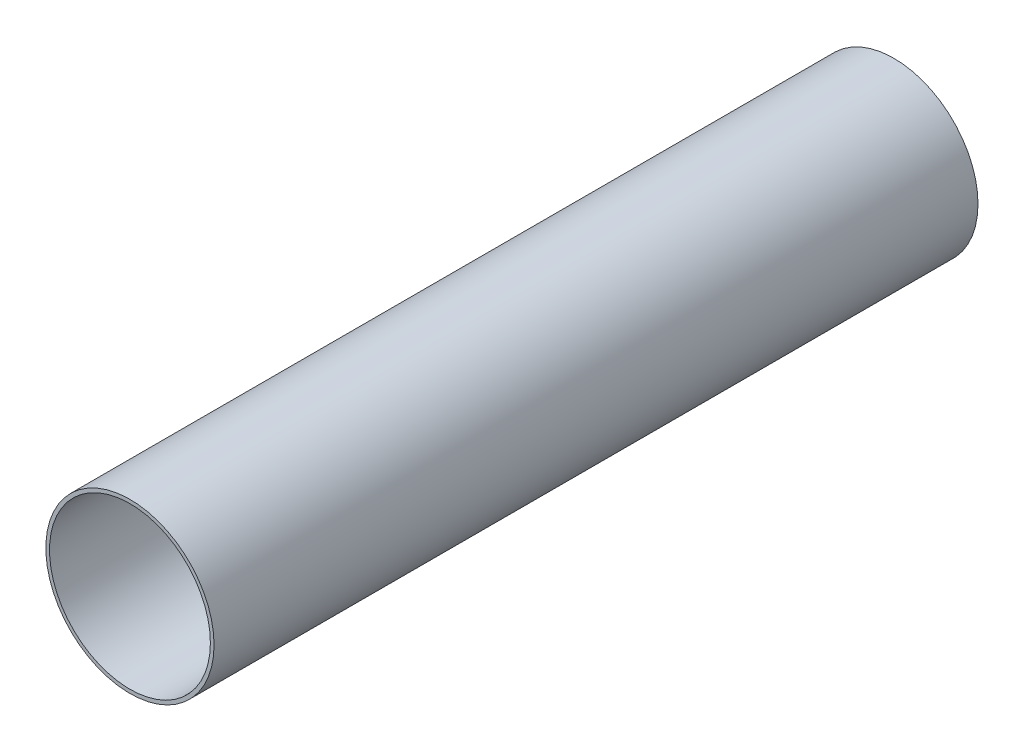
ISO-10303-21;
HEADER;
FILE_DESCRIPTION(('STEP AP214'),'2;1');
FILE_NAME('part.step','',(''),(''),'','','');
FILE_SCHEMA(('AUTOMOTIVE_DESIGN { 1 0 10303 214 1 1 1 1 }'));
ENDSEC;
DATA;
#1=APPLICATION_CONTEXT('core data for automotive mechanical design processes');
#2=APPLICATION_PROTOCOL_DEFINITION('international standard','automotive_design',2000,#1);
#3=PRODUCT_CONTEXT('',#1,'mechanical');
#4=PRODUCT('Part','Part','',(#3));
#5=PRODUCT_RELATED_PRODUCT_CATEGORY('part','',(#4));
#6=PRODUCT_DEFINITION_FORMATION('','',#4);
#7=PRODUCT_DEFINITION_CONTEXT('part definition',#1,'design');
#8=PRODUCT_DEFINITION('design','',#6,#7);
#9=PRODUCT_DEFINITION_SHAPE('','',#8);
#10=(LENGTH_UNIT() NAMED_UNIT(*) SI_UNIT(.MILLI.,.METRE.));
#11=(NAMED_UNIT(*) PLANE_ANGLE_UNIT() SI_UNIT($,.RADIAN.));
#12=(NAMED_UNIT(*) SI_UNIT($,.STERADIAN.) SOLID_ANGLE_UNIT());
#13=UNCERTAINTY_MEASURE_WITH_UNIT(LENGTH_MEASURE(1.E-05),#10,'distance_accuracy_value','');
#14=(GEOMETRIC_REPRESENTATION_CONTEXT(3) GLOBAL_UNCERTAINTY_ASSIGNED_CONTEXT((#13)) GLOBAL_UNIT_ASSIGNED_CONTEXT((#10,
#11,#12)) REPRESENTATION_CONTEXT('',''));
#15=CARTESIAN_POINT('',(0.,0.,0.));
#16=DIRECTION('',(0.,0.,1.));
#17=DIRECTION('',(1.,0.,0.));
#18=AXIS2_PLACEMENT_3D('',#15,#16,#17);
#19=CARTESIAN_POINT('',(0.,0.,-260.));
#20=DIRECTION('',(0.,0.,1.));
#21=DIRECTION('',(1.,0.,0.));
#22=AXIS2_PLACEMENT_3D('',#19,#20,#21);
#23=CYLINDRICAL_SURFACE('',#22,28.625);
#24=CARTESIAN_POINT('',(0.,0.,-260.));
#25=DIRECTION('',(0.,0.,1.));
#26=DIRECTION('',(1.,0.,0.));
#27=AXIS2_PLACEMENT_3D('',#24,#25,#26);
#28=CIRCLE('',#27,28.625);
#29=CARTESIAN_POINT('',(28.625,0.,-260.));
#30=VERTEX_POINT('',#29);
#31=EDGE_CURVE('E10',#30,#30,#28,.T.);
#32=ORIENTED_EDGE('',*,*,#31,.T.);
#33=EDGE_LOOP('',(#32));
#34=FACE_BOUND('',#33,.T.);
#35=CARTESIAN_POINT('',(0.,0.,0.));
#36=DIRECTION('',(0.,0.,1.));
#37=DIRECTION('',(1.,0.,0.));
#38=AXIS2_PLACEMENT_3D('',#35,#36,#37);
#39=CIRCLE('',#38,28.625);
#40=CARTESIAN_POINT('',(28.625,0.,0.));
#41=VERTEX_POINT('',#40);
#42=EDGE_CURVE('E44',#41,#41,#39,.T.);
#43=ORIENTED_EDGE('',*,*,#42,.F.);
#44=EDGE_LOOP('',(#43));
#45=FACE_BOUND('',#44,.T.);
#46=ADVANCED_FACE('F41',(#34,#45),#23,.T.);
#47=CARTESIAN_POINT('',(0.,0.,-260.));
#48=DIRECTION('',(0.,0.,1.));
#49=DIRECTION('',(1.,0.,0.));
#50=AXIS2_PLACEMENT_3D('',#47,#48,#49);
#51=PLANE('',#50);
#52=CARTESIAN_POINT('',(0.,0.,-260.));
#53=DIRECTION('',(0.,0.,1.));
#54=DIRECTION('',(1.,0.,0.));
#55=AXIS2_PLACEMENT_3D('',#52,#53,#54);
#56=CIRCLE('',#55,27.375);
#57=CARTESIAN_POINT('',(27.375,0.,-260.));
#58=VERTEX_POINT('',#57);
#59=EDGE_CURVE('E53',#58,#58,#56,.F.);
#60=ORIENTED_EDGE('',*,*,#59,.F.);
#61=EDGE_LOOP('',(#60));
#62=FACE_BOUND('',#61,.T.);
#63=ORIENTED_EDGE('',*,*,#31,.F.);
#64=EDGE_LOOP('',(#63));
#65=FACE_BOUND('',#64,.T.);
#66=ADVANCED_FACE('F69',(#62,#65),#51,.F.);
#67=CARTESIAN_POINT('',(0.,0.,0.));
#68=DIRECTION('',(0.,0.,1.));
#69=DIRECTION('',(1.,0.,0.));
#70=AXIS2_PLACEMENT_3D('',#67,#68,#69);
#71=PLANE('',#70);
#72=CARTESIAN_POINT('',(0.,0.,0.));
#73=DIRECTION('',(0.,0.,1.));
#74=DIRECTION('',(1.,0.,0.));
#75=AXIS2_PLACEMENT_3D('',#72,#73,#74);
#76=CIRCLE('',#75,27.375);
#77=CARTESIAN_POINT('',(27.375,0.,0.));
#78=VERTEX_POINT('',#77);
#79=EDGE_CURVE('E58',#78,#78,#76,.T.);
#80=ORIENTED_EDGE('',*,*,#79,.F.);
#81=EDGE_LOOP('',(#80));
#82=FACE_BOUND('',#81,.T.);
#83=ORIENTED_EDGE('',*,*,#42,.T.);
#84=EDGE_LOOP('',(#83));
#85=FACE_BOUND('',#84,.T.);
#86=ADVANCED_FACE('F66',(#82,#85),#71,.T.);
#87=CARTESIAN_POINT('',(0.,0.,-260.001));
#88=DIRECTION('',(0.,0.,1.));
#89=DIRECTION('',(1.,0.,0.));
#90=AXIS2_PLACEMENT_3D('',#87,#88,#89);
#91=CYLINDRICAL_SURFACE('',#90,27.375);
#92=ORIENTED_EDGE('',*,*,#79,.T.);
#93=EDGE_LOOP('',(#92));
#94=FACE_BOUND('',#93,.T.);
#95=ORIENTED_EDGE('',*,*,#59,.T.);
#96=EDGE_LOOP('',(#95));
#97=FACE_BOUND('',#96,.T.);
#98=ADVANCED_FACE('F63',(#94,#97),#91,.F.);
#99=CLOSED_SHELL('',(#46,#66,#86,#98));
#100=MANIFOLD_SOLID_BREP('B2',#99);
#101=ADVANCED_BREP_SHAPE_REPRESENTATION('',(#18,#100),#14);
#102=SHAPE_DEFINITION_REPRESENTATION(#9,#101);
ENDSEC;
END-ISO-10303-21;
